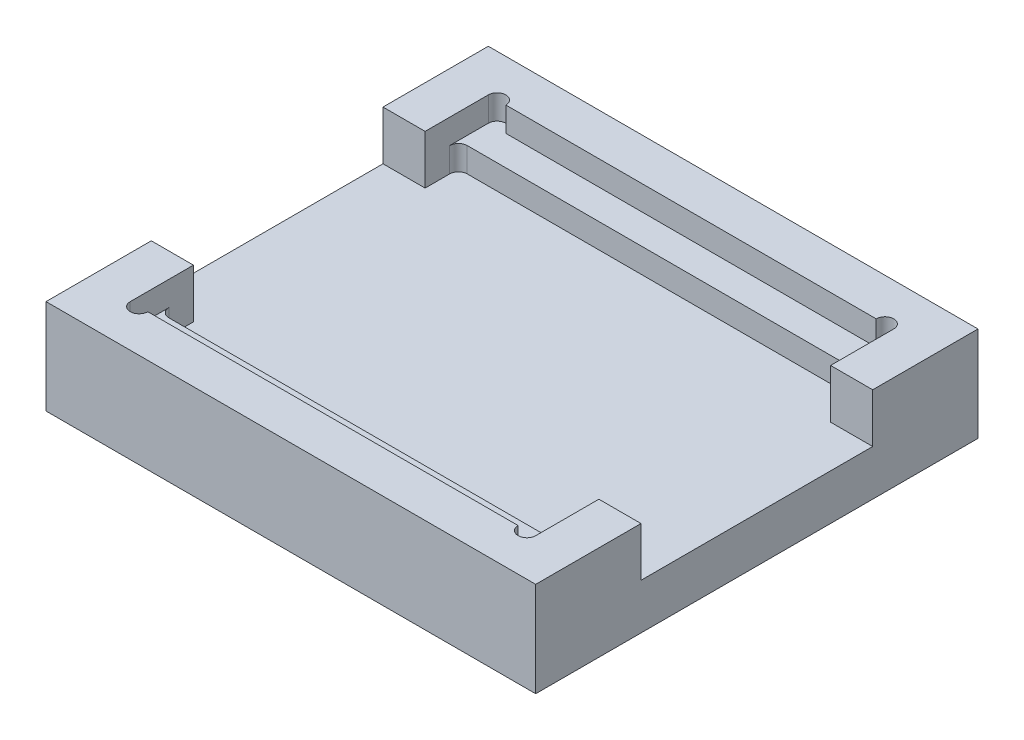
ISO-10303-21;
HEADER;
FILE_DESCRIPTION(('STEP AP214'),'2;1');
FILE_NAME('part.step','',(''),(''),'','','');
FILE_SCHEMA(('AUTOMOTIVE_DESIGN { 1 0 10303 214 1 1 1 1 }'));
ENDSEC;
DATA;
#1=APPLICATION_CONTEXT('core data for automotive mechanical design processes');
#2=APPLICATION_PROTOCOL_DEFINITION('international standard','automotive_design',2000,#1);
#3=PRODUCT_CONTEXT('',#1,'mechanical');
#4=PRODUCT('Part','Part','',(#3));
#5=PRODUCT_RELATED_PRODUCT_CATEGORY('part','',(#4));
#6=PRODUCT_DEFINITION_FORMATION('','',#4);
#7=PRODUCT_DEFINITION_CONTEXT('part definition',#1,'design');
#8=PRODUCT_DEFINITION('design','',#6,#7);
#9=PRODUCT_DEFINITION_SHAPE('','',#8);
#10=(LENGTH_UNIT() NAMED_UNIT(*) SI_UNIT(.MILLI.,.METRE.));
#11=(NAMED_UNIT(*) PLANE_ANGLE_UNIT() SI_UNIT($,.RADIAN.));
#12=(NAMED_UNIT(*) SI_UNIT($,.STERADIAN.) SOLID_ANGLE_UNIT());
#13=UNCERTAINTY_MEASURE_WITH_UNIT(LENGTH_MEASURE(1.E-05),#10,'distance_accuracy_value','');
#14=(GEOMETRIC_REPRESENTATION_CONTEXT(3) GLOBAL_UNCERTAINTY_ASSIGNED_CONTEXT((#13)) GLOBAL_UNIT_ASSIGNED_CONTEXT((#10,
#11,#12)) REPRESENTATION_CONTEXT('',''));
#15=CARTESIAN_POINT('',(0.,0.,0.));
#16=DIRECTION('',(0.,0.,1.));
#17=DIRECTION('',(1.,0.,0.));
#18=AXIS2_PLACEMENT_3D('',#15,#16,#17);
#19=CARTESIAN_POINT('',(0.,27.,0.));
#20=DIRECTION('',(0.,-1.,0.));
#21=DIRECTION('',(0.,0.,-1.));
#22=AXIS2_PLACEMENT_3D('',#19,#20,#21);
#23=PLANE('',#22);
#24=DIRECTION('',(0.,0.,-1.));
#25=VECTOR('',#24,1.);
#26=CARTESIAN_POINT('',(127.5,27.,-114.));
#27=LINE('',#26,#25);
#28=CARTESIAN_POINT('',(127.5,27.,-12.));
#29=VERTEX_POINT('',#28);
#30=CARTESIAN_POINT('',(127.5,27.,-30.));
#31=VERTEX_POINT('',#30);
#32=EDGE_CURVE('E259',#29,#31,#27,.T.);
#33=ORIENTED_EDGE('',*,*,#32,.F.);
#34=CARTESIAN_POINT('',(125.,27.,-12.));
#35=DIRECTION('',(0.,1.,0.));
#36=DIRECTION('',(0.,0.,-1.));
#37=AXIS2_PLACEMENT_3D('',#34,#35,#36);
#38=CIRCLE('',#37,2.5);
#39=CARTESIAN_POINT('',(122.5,27.,-12.));
#40=VERTEX_POINT('',#39);
#41=EDGE_CURVE('E590',#40,#29,#38,.T.);
#42=ORIENTED_EDGE('',*,*,#41,.F.);
#43=DIRECTION('',(1.,0.,0.));
#44=VECTOR('',#43,1.);
#45=CARTESIAN_POINT('',(11.9999999999999,27.,-12.));
#46=LINE('',#45,#44);
#47=CARTESIAN_POINT('',(16.9999999999999,27.,-12.));
#48=VERTEX_POINT('',#47);
#49=EDGE_CURVE('E436',#48,#40,#46,.T.);
#50=ORIENTED_EDGE('',*,*,#49,.F.);
#51=CARTESIAN_POINT('',(14.4999999999999,27.,-12.));
#52=DIRECTION('',(0.,1.,0.));
#53=DIRECTION('',(0.,0.,1.));
#54=AXIS2_PLACEMENT_3D('',#51,#52,#53);
#55=CIRCLE('',#54,2.5);
#56=CARTESIAN_POINT('',(11.9999999999999,27.,-12.));
#57=VERTEX_POINT('',#56);
#58=EDGE_CURVE('E579',#57,#48,#55,.T.);
#59=ORIENTED_EDGE('',*,*,#58,.F.);
#60=DIRECTION('',(0.,0.,1.));
#61=VECTOR('',#60,1.);
#62=CARTESIAN_POINT('',(11.9999999999999,27.,-114.));
#63=LINE('',#62,#61);
#64=CARTESIAN_POINT('',(11.9999999999999,27.,-30.));
#65=VERTEX_POINT('',#64);
#66=EDGE_CURVE('E414',#65,#57,#63,.T.);
#67=ORIENTED_EDGE('',*,*,#66,.F.);
#68=DIRECTION('',(1.,0.,0.));
#69=VECTOR('',#68,1.);
#70=CARTESIAN_POINT('',(1.37667655053519E-13,27.,-30.));
#71=LINE('',#70,#69);
#72=CARTESIAN_POINT('',(1.37667655053519E-13,27.,-30.));
#73=VERTEX_POINT('',#72);
#74=EDGE_CURVE('E483',#73,#65,#71,.T.);
#75=ORIENTED_EDGE('',*,*,#74,.F.);
#76=DIRECTION('',(0.,0.,1.));
#77=VECTOR('',#76,1.);
#78=CARTESIAN_POINT('',(0.,27.,0.));
#79=LINE('',#78,#77);
#80=CARTESIAN_POINT('',(0.,27.,0.));
#81=VERTEX_POINT('',#80);
#82=EDGE_CURVE('E290',#73,#81,#79,.T.);
#83=ORIENTED_EDGE('',*,*,#82,.T.);
#84=DIRECTION('',(1.,0.,0.));
#85=VECTOR('',#84,1.);
#86=CARTESIAN_POINT('',(0.,27.,0.));
#87=LINE('',#86,#85);
#88=CARTESIAN_POINT('',(139.5,27.,0.));
#89=VERTEX_POINT('',#88);
#90=EDGE_CURVE('E289',#81,#89,#87,.T.);
#91=ORIENTED_EDGE('',*,*,#90,.T.);
#92=DIRECTION('',(0.,0.,-1.));
#93=VECTOR('',#92,1.);
#94=CARTESIAN_POINT('',(139.5,27.,0.));
#95=LINE('',#94,#93);
#96=CARTESIAN_POINT('',(139.5,27.,-30.));
#97=VERTEX_POINT('',#96);
#98=EDGE_CURVE('E294',#89,#97,#95,.T.);
#99=ORIENTED_EDGE('',*,*,#98,.T.);
#100=DIRECTION('',(1.,0.,0.));
#101=VECTOR('',#100,1.);
#102=CARTESIAN_POINT('',(139.5,27.,-30.));
#103=LINE('',#102,#101);
#104=EDGE_CURVE('E457',#31,#97,#103,.T.);
#105=ORIENTED_EDGE('',*,*,#104,.F.);
#106=EDGE_LOOP('',(#33,#42,#50,#59,#67,#75,#83,#91,#99,#105));
#107=FACE_BOUND('',#106,.T.);
#108=ADVANCED_FACE('F44',(#107),#23,.F.);
#109=CARTESIAN_POINT('',(127.5,20.,-114.));
#110=DIRECTION('',(1.,0.,0.));
#111=DIRECTION('',(0.,0.,-1.));
#112=AXIS2_PLACEMENT_3D('',#109,#110,#111);
#113=PLANE('',#112);
#114=DIRECTION('',(0.,0.,-1.));
#115=VECTOR('',#114,1.);
#116=CARTESIAN_POINT('',(127.5,13.,-105.5));
#117=LINE('',#116,#115);
#118=CARTESIAN_POINT('',(127.5,13.,-23.));
#119=VERTEX_POINT('',#118);
#120=CARTESIAN_POINT('',(127.5,13.,-30.));
#121=VERTEX_POINT('',#120);
#122=EDGE_CURVE('E408',#119,#121,#117,.T.);
#123=ORIENTED_EDGE('',*,*,#122,.F.);
#124=DIRECTION('',(0.,1.,0.));
#125=VECTOR('',#124,1.);
#126=CARTESIAN_POINT('',(127.5,20.,-23.));
#127=LINE('',#126,#125);
#128=CARTESIAN_POINT('',(127.5,20.,-23.));
#129=VERTEX_POINT('',#128);
#130=EDGE_CURVE('E329',#119,#129,#127,.T.);
#131=ORIENTED_EDGE('',*,*,#130,.T.);
#132=DIRECTION('',(0.,0.,-1.));
#133=VECTOR('',#132,1.);
#134=CARTESIAN_POINT('',(127.5,20.,-114.));
#135=LINE('',#134,#133);
#136=CARTESIAN_POINT('',(127.5,20.,-12.));
#137=VERTEX_POINT('',#136);
#138=EDGE_CURVE('E429',#137,#129,#135,.T.);
#139=ORIENTED_EDGE('',*,*,#138,.F.);
#140=DIRECTION('',(0.,1.,0.));
#141=VECTOR('',#140,1.);
#142=CARTESIAN_POINT('',(127.5,20.,-12.));
#143=LINE('',#142,#141);
#144=EDGE_CURVE('E278',#137,#29,#143,.T.);
#145=ORIENTED_EDGE('',*,*,#144,.T.);
#146=ORIENTED_EDGE('',*,*,#32,.T.);
#147=DIRECTION('',(0.,1.,0.));
#148=VECTOR('',#147,1.);
#149=CARTESIAN_POINT('',(127.5,13.,-30.));
#150=LINE('',#149,#148);
#151=EDGE_CURVE('E571',#121,#31,#150,.T.);
#152=ORIENTED_EDGE('',*,*,#151,.F.);
#153=EDGE_LOOP('',(#123,#131,#139,#145,#146,#152));
#154=FACE_BOUND('',#153,.T.);
#155=ADVANCED_FACE('F609',(#154),#113,.F.);
#156=CARTESIAN_POINT('',(11.9999999999999,20.,-114.));
#157=DIRECTION('',(-1.,0.,0.));
#158=DIRECTION('',(0.,0.,1.));
#159=AXIS2_PLACEMENT_3D('',#156,#157,#158);
#160=PLANE('',#159);
#161=DIRECTION('',(0.,0.,1.));
#162=VECTOR('',#161,1.);
#163=CARTESIAN_POINT('',(11.9999999999999,13.,-105.5));
#164=LINE('',#163,#162);
#165=CARTESIAN_POINT('',(11.9999999999999,13.,-103.));
#166=VERTEX_POINT('',#165);
#167=CARTESIAN_POINT('',(11.9999999999999,13.,-96.));
#168=VERTEX_POINT('',#167);
#169=EDGE_CURVE('E400',#166,#168,#164,.T.);
#170=ORIENTED_EDGE('',*,*,#169,.F.);
#171=DIRECTION('',(0.,1.,0.));
#172=VECTOR('',#171,1.);
#173=CARTESIAN_POINT('',(11.9999999999999,20.,-103.));
#174=LINE('',#173,#172);
#175=CARTESIAN_POINT('',(11.9999999999999,20.,-103.));
#176=VERTEX_POINT('',#175);
#177=EDGE_CURVE('E365',#166,#176,#174,.T.);
#178=ORIENTED_EDGE('',*,*,#177,.T.);
#179=DIRECTION('',(0.,0.,1.));
#180=VECTOR('',#179,1.);
#181=CARTESIAN_POINT('',(11.9999999999999,20.,-114.));
#182=LINE('',#181,#180);
#183=CARTESIAN_POINT('',(11.9999999999999,20.,-114.));
#184=VERTEX_POINT('',#183);
#185=EDGE_CURVE('E59',#184,#176,#182,.T.);
#186=ORIENTED_EDGE('',*,*,#185,.F.);
#187=DIRECTION('',(0.,1.,0.));
#188=VECTOR('',#187,1.);
#189=CARTESIAN_POINT('',(11.9999999999999,20.,-114.));
#190=LINE('',#189,#188);
#191=CARTESIAN_POINT('',(11.9999999999999,27.,-114.));
#192=VERTEX_POINT('',#191);
#193=EDGE_CURVE('E271',#184,#192,#190,.T.);
#194=ORIENTED_EDGE('',*,*,#193,.T.);
#195=CARTESIAN_POINT('',(11.9999999999999,27.,-96.));
#196=VERTEX_POINT('',#195);
#197=EDGE_CURVE('E433',#192,#196,#63,.T.);
#198=ORIENTED_EDGE('',*,*,#197,.T.);
#199=DIRECTION('',(0.,1.,0.));
#200=VECTOR('',#199,1.);
#201=CARTESIAN_POINT('',(11.9999999999999,13.,-96.));
#202=LINE('',#201,#200);
#203=EDGE_CURVE('E492',#168,#196,#202,.T.);
#204=ORIENTED_EDGE('',*,*,#203,.F.);
#205=EDGE_LOOP('',(#170,#178,#186,#194,#198,#204));
#206=FACE_BOUND('',#205,.T.);
#207=ADVANCED_FACE('F526',(#206),#160,.F.);
#208=CARTESIAN_POINT('',(0.,20.,0.));
#209=DIRECTION('',(0.,1.,0.));
#210=DIRECTION('',(0.,0.,1.));
#211=AXIS2_PLACEMENT_3D('',#208,#209,#210);
#212=PLANE('',#211);
#213=DIRECTION('',(-1.,0.,0.));
#214=VECTOR('',#213,1.);
#215=CARTESIAN_POINT('',(127.5,20.,-105.5));
#216=LINE('',#215,#214);
#217=CARTESIAN_POINT('',(125.,20.,-105.5));
#218=VERTEX_POINT('',#217);
#219=CARTESIAN_POINT('',(14.4999999999999,20.,-105.5));
#220=VERTEX_POINT('',#219);
#221=EDGE_CURVE('E415',#218,#220,#216,.T.);
#222=ORIENTED_EDGE('',*,*,#221,.F.);
#223=CARTESIAN_POINT('',(125.,20.,-103.));
#224=DIRECTION('',(0.,1.,0.));
#225=DIRECTION('',(0.,0.,1.));
#226=AXIS2_PLACEMENT_3D('',#223,#224,#225);
#227=CIRCLE('',#226,2.5);
#228=CARTESIAN_POINT('',(127.5,20.,-103.));
#229=VERTEX_POINT('',#228);
#230=EDGE_CURVE('E372',#218,#229,#227,.F.);
#231=ORIENTED_EDGE('',*,*,#230,.T.);
#232=CARTESIAN_POINT('',(127.5,20.,-114.));
#233=VERTEX_POINT('',#232);
#234=EDGE_CURVE('E428',#229,#233,#135,.T.);
#235=ORIENTED_EDGE('',*,*,#234,.T.);
#236=CARTESIAN_POINT('',(125.,20.,-114.));
#237=DIRECTION('',(0.,1.,0.));
#238=DIRECTION('',(0.,0.,1.));
#239=AXIS2_PLACEMENT_3D('',#236,#237,#238);
#240=CIRCLE('',#239,2.5);
#241=CARTESIAN_POINT('',(122.5,20.,-114.));
#242=VERTEX_POINT('',#241);
#243=EDGE_CURVE('E252',#242,#233,#240,.F.);
#244=ORIENTED_EDGE('',*,*,#243,.F.);
#245=DIRECTION('',(-1.,0.,0.));
#246=VECTOR('',#245,1.);
#247=CARTESIAN_POINT('',(11.9999999999999,20.,-114.));
#248=LINE('',#247,#246);
#249=CARTESIAN_POINT('',(16.9999999999999,20.,-114.));
#250=VERTEX_POINT('',#249);
#251=EDGE_CURVE('E250',#242,#250,#248,.T.);
#252=ORIENTED_EDGE('',*,*,#251,.T.);
#253=CARTESIAN_POINT('',(14.4999999999999,20.,-114.));
#254=DIRECTION('',(0.,1.,0.));
#255=DIRECTION('',(0.,0.,1.));
#256=AXIS2_PLACEMENT_3D('',#253,#254,#255);
#257=CIRCLE('',#256,2.5);
#258=EDGE_CURVE('E587',#184,#250,#257,.F.);
#259=ORIENTED_EDGE('',*,*,#258,.F.);
#260=ORIENTED_EDGE('',*,*,#185,.T.);
#261=CARTESIAN_POINT('',(14.4999999999999,20.,-103.));
#262=DIRECTION('',(0.,1.,0.));
#263=DIRECTION('',(0.,0.,1.));
#264=AXIS2_PLACEMENT_3D('',#261,#262,#263);
#265=CIRCLE('',#264,2.5);
#266=EDGE_CURVE('E12',#176,#220,#265,.F.);
#267=ORIENTED_EDGE('',*,*,#266,.T.);
#268=EDGE_LOOP('',(#222,#231,#235,#244,#252,#259,#260,#267));
#269=FACE_BOUND('',#268,.T.);
#270=ADVANCED_FACE('F519',(#269),#212,.T.);
#271=CARTESIAN_POINT('',(0.,27.,0.));
#272=DIRECTION('',(1.,0.,0.));
#273=DIRECTION('',(0.,0.,-1.));
#274=AXIS2_PLACEMENT_3D('',#271,#272,#273);
#275=PLANE('',#274);
#276=DIRECTION('',(0.,0.,1.));
#277=VECTOR('',#276,1.);
#278=CARTESIAN_POINT('',(1.37667655053519E-13,13.,-30.));
#279=LINE('',#278,#277);
#280=CARTESIAN_POINT('',(0.,13.,-96.));
#281=VERTEX_POINT('',#280);
#282=CARTESIAN_POINT('',(1.37667655053519E-13,13.,-30.));
#283=VERTEX_POINT('',#282);
#284=EDGE_CURVE('E472',#281,#283,#279,.T.);
#285=ORIENTED_EDGE('',*,*,#284,.F.);
#286=DIRECTION('',(0.,1.,0.));
#287=VECTOR('',#286,1.);
#288=CARTESIAN_POINT('',(0.,13.,-96.));
#289=LINE('',#288,#287);
#290=CARTESIAN_POINT('',(0.,27.,-96.));
#291=VERTEX_POINT('',#290);
#292=EDGE_CURVE('E419',#281,#291,#289,.T.);
#293=ORIENTED_EDGE('',*,*,#292,.T.);
#294=CARTESIAN_POINT('',(0.,27.,-126.));
#295=VERTEX_POINT('',#294);
#296=EDGE_CURVE('E285',#295,#291,#79,.T.);
#297=ORIENTED_EDGE('',*,*,#296,.F.);
#298=DIRECTION('',(0.,-1.,0.));
#299=VECTOR('',#298,1.);
#300=CARTESIAN_POINT('',(0.,27.,-126.));
#301=LINE('',#300,#299);
#302=CARTESIAN_POINT('',(0.,0.,-126.));
#303=VERTEX_POINT('',#302);
#304=EDGE_CURVE('E301',#295,#303,#301,.T.);
#305=ORIENTED_EDGE('',*,*,#304,.T.);
#306=DIRECTION('',(0.,0.,1.));
#307=VECTOR('',#306,1.);
#308=CARTESIAN_POINT('',(0.,0.,0.));
#309=LINE('',#308,#307);
#310=CARTESIAN_POINT('',(0.,0.,0.));
#311=VERTEX_POINT('',#310);
#312=EDGE_CURVE('E275',#303,#311,#309,.T.);
#313=ORIENTED_EDGE('',*,*,#312,.T.);
#314=DIRECTION('',(0.,-1.,0.));
#315=VECTOR('',#314,1.);
#316=CARTESIAN_POINT('',(0.,27.,0.));
#317=LINE('',#316,#315);
#318=EDGE_CURVE('E325',#81,#311,#317,.T.);
#319=ORIENTED_EDGE('',*,*,#318,.F.);
#320=ORIENTED_EDGE('',*,*,#82,.F.);
#321=DIRECTION('',(0.,1.,0.));
#322=VECTOR('',#321,1.);
#323=CARTESIAN_POINT('',(1.37667655053519E-13,13.,-30.));
#324=LINE('',#323,#322);
#325=EDGE_CURVE('E476',#283,#73,#324,.T.);
#326=ORIENTED_EDGE('',*,*,#325,.F.);
#327=EDGE_LOOP('',(#285,#293,#297,#305,#313,#319,#320,#326));
#328=FACE_BOUND('',#327,.T.);
#329=ADVANCED_FACE('F535',(#328),#275,.F.);
#330=CARTESIAN_POINT('',(0.,27.,0.));
#331=DIRECTION('',(0.,0.,-1.));
#332=DIRECTION('',(-1.,0.,0.));
#333=AXIS2_PLACEMENT_3D('',#330,#331,#332);
#334=PLANE('',#333);
#335=DIRECTION('',(1.,0.,0.));
#336=VECTOR('',#335,1.);
#337=CARTESIAN_POINT('',(0.,0.,0.));
#338=LINE('',#337,#336);
#339=CARTESIAN_POINT('',(139.5,0.,0.));
#340=VERTEX_POINT('',#339);
#341=EDGE_CURVE('E305',#311,#340,#338,.T.);
#342=ORIENTED_EDGE('',*,*,#341,.T.);
#343=DIRECTION('',(0.,-1.,0.));
#344=VECTOR('',#343,1.);
#345=CARTESIAN_POINT('',(139.5,27.,0.));
#346=LINE('',#345,#344);
#347=EDGE_CURVE('E321',#89,#340,#346,.T.);
#348=ORIENTED_EDGE('',*,*,#347,.F.);
#349=ORIENTED_EDGE('',*,*,#90,.F.);
#350=ORIENTED_EDGE('',*,*,#318,.T.);
#351=EDGE_LOOP('',(#342,#348,#349,#350));
#352=FACE_BOUND('',#351,.T.);
#353=ADVANCED_FACE('F549',(#352),#334,.F.);
#354=CARTESIAN_POINT('',(139.5,27.,0.));
#355=DIRECTION('',(-1.,0.,0.));
#356=DIRECTION('',(0.,0.,1.));
#357=AXIS2_PLACEMENT_3D('',#354,#355,#356);
#358=PLANE('',#357);
#359=DIRECTION('',(0.,0.,-1.));
#360=VECTOR('',#359,1.);
#361=CARTESIAN_POINT('',(139.5,13.,-96.));
#362=LINE('',#361,#360);
#363=CARTESIAN_POINT('',(139.5,13.,-30.));
#364=VERTEX_POINT('',#363);
#365=CARTESIAN_POINT('',(139.5,13.,-96.));
#366=VERTEX_POINT('',#365);
#367=EDGE_CURVE('E556',#364,#366,#362,.T.);
#368=ORIENTED_EDGE('',*,*,#367,.F.);
#369=DIRECTION('',(0.,1.,0.));
#370=VECTOR('',#369,1.);
#371=CARTESIAN_POINT('',(139.5,13.,-30.));
#372=LINE('',#371,#370);
#373=EDGE_CURVE('E486',#364,#97,#372,.T.);
#374=ORIENTED_EDGE('',*,*,#373,.T.);
#375=ORIENTED_EDGE('',*,*,#98,.F.);
#376=ORIENTED_EDGE('',*,*,#347,.T.);
#377=DIRECTION('',(0.,0.,-1.));
#378=VECTOR('',#377,1.);
#379=CARTESIAN_POINT('',(139.5,0.,0.));
#380=LINE('',#379,#378);
#381=CARTESIAN_POINT('',(139.5,0.,-126.));
#382=VERTEX_POINT('',#381);
#383=EDGE_CURVE('E308',#340,#382,#380,.T.);
#384=ORIENTED_EDGE('',*,*,#383,.T.);
#385=DIRECTION('',(0.,-1.,0.));
#386=VECTOR('',#385,1.);
#387=CARTESIAN_POINT('',(139.5,27.,-126.));
#388=LINE('',#387,#386);
#389=CARTESIAN_POINT('',(139.5,27.,-126.));
#390=VERTEX_POINT('',#389);
#391=EDGE_CURVE('E317',#390,#382,#388,.T.);
#392=ORIENTED_EDGE('',*,*,#391,.F.);
#393=CARTESIAN_POINT('',(139.5,27.,-96.));
#394=VERTEX_POINT('',#393);
#395=EDGE_CURVE('E293',#394,#390,#95,.T.);
#396=ORIENTED_EDGE('',*,*,#395,.F.);
#397=DIRECTION('',(0.,1.,0.));
#398=VECTOR('',#397,1.);
#399=CARTESIAN_POINT('',(139.5,13.,-96.));
#400=LINE('',#399,#398);
#401=EDGE_CURVE('E464',#366,#394,#400,.T.);
#402=ORIENTED_EDGE('',*,*,#401,.F.);
#403=EDGE_LOOP('',(#368,#374,#375,#376,#384,#392,#396,#402));
#404=FACE_BOUND('',#403,.T.);
#405=ADVANCED_FACE('F463',(#404),#358,.F.);
#406=CARTESIAN_POINT('',(0.,27.,-126.));
#407=DIRECTION('',(0.,0.,1.));
#408=DIRECTION('',(1.,0.,0.));
#409=AXIS2_PLACEMENT_3D('',#406,#407,#408);
#410=PLANE('',#409);
#411=DIRECTION('',(-1.,0.,0.));
#412=VECTOR('',#411,1.);
#413=CARTESIAN_POINT('',(0.,0.,-126.));
#414=LINE('',#413,#412);
#415=EDGE_CURVE('E311',#382,#303,#414,.T.);
#416=ORIENTED_EDGE('',*,*,#415,.T.);
#417=ORIENTED_EDGE('',*,*,#304,.F.);
#418=DIRECTION('',(-1.,0.,0.));
#419=VECTOR('',#418,1.);
#420=CARTESIAN_POINT('',(0.,27.,-126.));
#421=LINE('',#420,#419);
#422=EDGE_CURVE('E298',#390,#295,#421,.T.);
#423=ORIENTED_EDGE('',*,*,#422,.F.);
#424=ORIENTED_EDGE('',*,*,#391,.T.);
#425=EDGE_LOOP('',(#416,#417,#423,#424));
#426=FACE_BOUND('',#425,.T.);
#427=ADVANCED_FACE('F539',(#426),#410,.F.);
#428=ORIENTED_EDGE('',*,*,#197,.F.);
#429=CARTESIAN_POINT('',(14.4999999999999,27.,-114.));
#430=DIRECTION('',(0.,1.,0.));
#431=DIRECTION('',(0.,0.,-1.));
#432=AXIS2_PLACEMENT_3D('',#429,#430,#431);
#433=CIRCLE('',#432,2.5);
#434=CARTESIAN_POINT('',(16.9999999999999,27.,-114.));
#435=VERTEX_POINT('',#434);
#436=EDGE_CURVE('E257',#435,#192,#433,.T.);
#437=ORIENTED_EDGE('',*,*,#436,.F.);
#438=DIRECTION('',(-1.,0.,0.));
#439=VECTOR('',#438,1.);
#440=CARTESIAN_POINT('',(11.9999999999999,27.,-114.));
#441=LINE('',#440,#439);
#442=CARTESIAN_POINT('',(122.5,27.,-114.));
#443=VERTEX_POINT('',#442);
#444=EDGE_CURVE('E248',#443,#435,#441,.T.);
#445=ORIENTED_EDGE('',*,*,#444,.F.);
#446=CARTESIAN_POINT('',(125.,27.,-114.));
#447=DIRECTION('',(0.,1.,0.));
#448=DIRECTION('',(0.,0.,1.));
#449=AXIS2_PLACEMENT_3D('',#446,#447,#448);
#450=CIRCLE('',#449,2.5);
#451=CARTESIAN_POINT('',(127.5,27.,-114.));
#452=VERTEX_POINT('',#451);
#453=EDGE_CURVE('E231',#452,#443,#450,.T.);
#454=ORIENTED_EDGE('',*,*,#453,.F.);
#455=CARTESIAN_POINT('',(127.5,27.,-96.));
#456=VERTEX_POINT('',#455);
#457=EDGE_CURVE('E267',#456,#452,#27,.T.);
#458=ORIENTED_EDGE('',*,*,#457,.F.);
#459=DIRECTION('',(-1.,0.,0.));
#460=VECTOR('',#459,1.);
#461=CARTESIAN_POINT('',(139.5,27.,-96.));
#462=LINE('',#461,#460);
#463=EDGE_CURVE('E452',#394,#456,#462,.T.);
#464=ORIENTED_EDGE('',*,*,#463,.F.);
#465=ORIENTED_EDGE('',*,*,#395,.T.);
#466=ORIENTED_EDGE('',*,*,#422,.T.);
#467=ORIENTED_EDGE('',*,*,#296,.T.);
#468=DIRECTION('',(-1.,0.,0.));
#469=VECTOR('',#468,1.);
#470=CARTESIAN_POINT('',(0.,27.,-96.));
#471=LINE('',#470,#469);
#472=EDGE_CURVE('E479',#196,#291,#471,.T.);
#473=ORIENTED_EDGE('',*,*,#472,.F.);
#474=EDGE_LOOP('',(#428,#437,#445,#454,#458,#464,#465,#466,#467,#473));
#475=FACE_BOUND('',#474,.T.);
#476=ADVANCED_FACE('F256',(#475),#23,.F.);
#477=CARTESIAN_POINT('',(0.,0.,0.));
#478=DIRECTION('',(0.,-1.,0.));
#479=DIRECTION('',(0.,0.,-1.));
#480=AXIS2_PLACEMENT_3D('',#477,#478,#479);
#481=PLANE('',#480);
#482=ORIENTED_EDGE('',*,*,#312,.F.);
#483=ORIENTED_EDGE('',*,*,#415,.F.);
#484=ORIENTED_EDGE('',*,*,#383,.F.);
#485=ORIENTED_EDGE('',*,*,#341,.F.);
#486=EDGE_LOOP('',(#482,#483,#484,#485));
#487=FACE_BOUND('',#486,.T.);
#488=ADVANCED_FACE('F544',(#487),#481,.T.);
#489=CARTESIAN_POINT('',(11.9999999999999,20.,-23.));
#490=VERTEX_POINT('',#489);
#491=CARTESIAN_POINT('',(11.9999999999999,20.,-12.));
#492=VERTEX_POINT('',#491);
#493=EDGE_CURVE('E67',#490,#492,#182,.T.);
#494=ORIENTED_EDGE('',*,*,#493,.F.);
#495=DIRECTION('',(0.,1.,0.));
#496=VECTOR('',#495,1.);
#497=CARTESIAN_POINT('',(11.9999999999999,13.,-23.));
#498=LINE('',#497,#496);
#499=CARTESIAN_POINT('',(11.9999999999999,13.,-23.));
#500=VERTEX_POINT('',#499);
#501=EDGE_CURVE('E362',#490,#500,#498,.F.);
#502=ORIENTED_EDGE('',*,*,#501,.T.);
#503=CARTESIAN_POINT('',(11.9999999999999,13.,-30.));
#504=VERTEX_POINT('',#503);
#505=EDGE_CURVE('E392',#504,#500,#164,.T.);
#506=ORIENTED_EDGE('',*,*,#505,.F.);
#507=DIRECTION('',(0.,1.,0.));
#508=VECTOR('',#507,1.);
#509=CARTESIAN_POINT('',(11.9999999999999,13.,-30.));
#510=LINE('',#509,#508);
#511=EDGE_CURVE('E495',#504,#65,#510,.T.);
#512=ORIENTED_EDGE('',*,*,#511,.T.);
#513=ORIENTED_EDGE('',*,*,#66,.T.);
#514=DIRECTION('',(0.,1.,0.));
#515=VECTOR('',#514,1.);
#516=CARTESIAN_POINT('',(11.9999999999999,20.,-12.));
#517=LINE('',#516,#515);
#518=EDGE_CURVE('E282',#492,#57,#517,.T.);
#519=ORIENTED_EDGE('',*,*,#518,.F.);
#520=EDGE_LOOP('',(#494,#502,#506,#512,#513,#519));
#521=FACE_BOUND('',#520,.T.);
#522=ADVANCED_FACE('F390',(#521),#160,.F.);
#523=CARTESIAN_POINT('',(11.9999999999999,20.,-114.));
#524=DIRECTION('',(0.,0.,-1.));
#525=DIRECTION('',(-1.,0.,0.));
#526=AXIS2_PLACEMENT_3D('',#523,#524,#525);
#527=PLANE('',#526);
#528=ORIENTED_EDGE('',*,*,#444,.T.);
#529=DIRECTION('',(0.,1.,0.));
#530=VECTOR('',#529,1.);
#531=CARTESIAN_POINT('',(16.9999999999999,14.4098300562505,-114.));
#532=LINE('',#531,#530);
#533=EDGE_CURVE('E585',#250,#435,#532,.T.);
#534=ORIENTED_EDGE('',*,*,#533,.F.);
#535=ORIENTED_EDGE('',*,*,#251,.F.);
#536=DIRECTION('',(0.,1.,0.));
#537=VECTOR('',#536,1.);
#538=CARTESIAN_POINT('',(122.5,14.4098300562505,-114.));
#539=LINE('',#538,#537);
#540=EDGE_CURVE('E234',#242,#443,#539,.T.);
#541=ORIENTED_EDGE('',*,*,#540,.T.);
#542=EDGE_LOOP('',(#528,#534,#535,#541));
#543=FACE_BOUND('',#542,.T.);
#544=ADVANCED_FACE('F246',(#543),#527,.F.);
#545=ORIENTED_EDGE('',*,*,#234,.F.);
#546=DIRECTION('',(0.,1.,0.));
#547=VECTOR('',#546,1.);
#548=CARTESIAN_POINT('',(127.5,13.,-103.));
#549=LINE('',#548,#547);
#550=CARTESIAN_POINT('',(127.5,13.,-103.));
#551=VERTEX_POINT('',#550);
#552=EDGE_CURVE('E359',#229,#551,#549,.F.);
#553=ORIENTED_EDGE('',*,*,#552,.T.);
#554=CARTESIAN_POINT('',(127.5,13.,-96.));
#555=VERTEX_POINT('',#554);
#556=EDGE_CURVE('E421',#555,#551,#117,.T.);
#557=ORIENTED_EDGE('',*,*,#556,.F.);
#558=DIRECTION('',(0.,1.,0.));
#559=VECTOR('',#558,1.);
#560=CARTESIAN_POINT('',(127.5,13.,-96.));
#561=LINE('',#560,#559);
#562=EDGE_CURVE('E450',#555,#456,#561,.T.);
#563=ORIENTED_EDGE('',*,*,#562,.T.);
#564=ORIENTED_EDGE('',*,*,#457,.T.);
#565=DIRECTION('',(0.,1.,0.));
#566=VECTOR('',#565,1.);
#567=CARTESIAN_POINT('',(127.5,20.,-114.));
#568=LINE('',#567,#566);
#569=EDGE_CURVE('E237',#233,#452,#568,.T.);
#570=ORIENTED_EDGE('',*,*,#569,.F.);
#571=EDGE_LOOP('',(#545,#553,#557,#563,#564,#570));
#572=FACE_BOUND('',#571,.T.);
#573=ADVANCED_FACE('F447',(#572),#113,.F.);
#574=CARTESIAN_POINT('',(11.9999999999999,20.,-12.));
#575=DIRECTION('',(0.,0.,1.));
#576=DIRECTION('',(1.,0.,0.));
#577=AXIS2_PLACEMENT_3D('',#574,#575,#576);
#578=PLANE('',#577);
#579=ORIENTED_EDGE('',*,*,#49,.T.);
#580=DIRECTION('',(0.,1.,0.));
#581=VECTOR('',#580,1.);
#582=CARTESIAN_POINT('',(122.5,14.4098300562505,-12.));
#583=LINE('',#582,#581);
#584=CARTESIAN_POINT('',(122.5,20.,-12.));
#585=VERTEX_POINT('',#584);
#586=EDGE_CURVE('E591',#585,#40,#583,.T.);
#587=ORIENTED_EDGE('',*,*,#586,.F.);
#588=DIRECTION('',(1.,0.,0.));
#589=VECTOR('',#588,1.);
#590=CARTESIAN_POINT('',(11.9999999999999,20.,-12.));
#591=LINE('',#590,#589);
#592=CARTESIAN_POINT('',(16.9999999999999,20.,-12.));
#593=VERTEX_POINT('',#592);
#594=EDGE_CURVE('E424',#593,#585,#591,.T.);
#595=ORIENTED_EDGE('',*,*,#594,.F.);
#596=DIRECTION('',(0.,1.,0.));
#597=VECTOR('',#596,1.);
#598=CARTESIAN_POINT('',(16.9999999999999,14.4098300562505,-12.));
#599=LINE('',#598,#597);
#600=EDGE_CURVE('E577',#593,#48,#599,.T.);
#601=ORIENTED_EDGE('',*,*,#600,.T.);
#602=EDGE_LOOP('',(#579,#587,#595,#601));
#603=FACE_BOUND('',#602,.T.);
#604=ADVANCED_FACE('F602',(#603),#578,.F.);
#605=DIRECTION('',(1.,0.,0.));
#606=VECTOR('',#605,1.);
#607=CARTESIAN_POINT('',(127.5,20.,-20.5));
#608=LINE('',#607,#606);
#609=CARTESIAN_POINT('',(14.4999999999999,20.,-20.5));
#610=VERTEX_POINT('',#609);
#611=CARTESIAN_POINT('',(125.,20.,-20.5));
#612=VERTEX_POINT('',#611);
#613=EDGE_CURVE('E383',#610,#612,#608,.T.);
#614=ORIENTED_EDGE('',*,*,#613,.F.);
#615=CARTESIAN_POINT('',(14.4999999999999,20.,-23.));
#616=DIRECTION('',(0.,1.,0.));
#617=DIRECTION('',(0.,0.,1.));
#618=AXIS2_PLACEMENT_3D('',#615,#616,#617);
#619=CIRCLE('',#618,2.5);
#620=EDGE_CURVE('E53',#610,#490,#619,.F.);
#621=ORIENTED_EDGE('',*,*,#620,.T.);
#622=ORIENTED_EDGE('',*,*,#493,.T.);
#623=CARTESIAN_POINT('',(14.4999999999999,20.,-12.));
#624=DIRECTION('',(0.,1.,0.));
#625=DIRECTION('',(0.,0.,1.));
#626=AXIS2_PLACEMENT_3D('',#623,#624,#625);
#627=CIRCLE('',#626,2.5);
#628=EDGE_CURVE('E458',#593,#492,#627,.F.);
#629=ORIENTED_EDGE('',*,*,#628,.F.);
#630=ORIENTED_EDGE('',*,*,#594,.T.);
#631=CARTESIAN_POINT('',(125.,20.,-12.));
#632=DIRECTION('',(0.,1.,0.));
#633=DIRECTION('',(0.,0.,1.));
#634=AXIS2_PLACEMENT_3D('',#631,#632,#633);
#635=CIRCLE('',#634,2.5);
#636=EDGE_CURVE('E582',#137,#585,#635,.F.);
#637=ORIENTED_EDGE('',*,*,#636,.F.);
#638=ORIENTED_EDGE('',*,*,#138,.T.);
#639=CARTESIAN_POINT('',(125.,20.,-23.));
#640=DIRECTION('',(0.,1.,0.));
#641=DIRECTION('',(0.,0.,1.));
#642=AXIS2_PLACEMENT_3D('',#639,#640,#641);
#643=CIRCLE('',#642,2.5);
#644=EDGE_CURVE('E369',#129,#612,#643,.F.);
#645=ORIENTED_EDGE('',*,*,#644,.T.);
#646=EDGE_LOOP('',(#614,#621,#622,#629,#630,#637,#638,#645));
#647=FACE_BOUND('',#646,.T.);
#648=ADVANCED_FACE('F380',(#647),#212,.T.);
#649=CARTESIAN_POINT('',(127.5,13.,-20.5));
#650=DIRECTION('',(0.,0.,1.));
#651=DIRECTION('',(1.,0.,0.));
#652=AXIS2_PLACEMENT_3D('',#649,#650,#651);
#653=PLANE('',#652);
#654=ORIENTED_EDGE('',*,*,#613,.T.);
#655=DIRECTION('',(0.,1.,0.));
#656=VECTOR('',#655,1.);
#657=CARTESIAN_POINT('',(125.,13.,-20.5));
#658=LINE('',#657,#656);
#659=CARTESIAN_POINT('',(125.,13.,-20.5));
#660=VERTEX_POINT('',#659);
#661=EDGE_CURVE('E337',#612,#660,#658,.F.);
#662=ORIENTED_EDGE('',*,*,#661,.T.);
#663=DIRECTION('',(1.,0.,0.));
#664=VECTOR('',#663,1.);
#665=CARTESIAN_POINT('',(127.5,13.,-20.5));
#666=LINE('',#665,#664);
#667=CARTESIAN_POINT('',(14.4999999999999,13.,-20.5));
#668=VERTEX_POINT('',#667);
#669=EDGE_CURVE('E405',#668,#660,#666,.T.);
#670=ORIENTED_EDGE('',*,*,#669,.F.);
#671=DIRECTION('',(0.,1.,0.));
#672=VECTOR('',#671,1.);
#673=CARTESIAN_POINT('',(14.4999999999999,20.,-20.5));
#674=LINE('',#673,#672);
#675=EDGE_CURVE('E333',#668,#610,#674,.T.);
#676=ORIENTED_EDGE('',*,*,#675,.T.);
#677=EDGE_LOOP('',(#654,#662,#670,#676));
#678=FACE_BOUND('',#677,.T.);
#679=ADVANCED_FACE('F618',(#678),#653,.F.);
#680=CARTESIAN_POINT('',(127.5,13.,-105.5));
#681=DIRECTION('',(0.,0.,-1.));
#682=DIRECTION('',(-1.,0.,0.));
#683=AXIS2_PLACEMENT_3D('',#680,#681,#682);
#684=PLANE('',#683);
#685=DIRECTION('',(-1.,0.,0.));
#686=VECTOR('',#685,1.);
#687=CARTESIAN_POINT('',(127.5,13.,-105.5));
#688=LINE('',#687,#686);
#689=CARTESIAN_POINT('',(125.,13.,-105.5));
#690=VERTEX_POINT('',#689);
#691=CARTESIAN_POINT('',(14.4999999999999,13.,-105.5));
#692=VERTEX_POINT('',#691);
#693=EDGE_CURVE('E401',#690,#692,#688,.T.);
#694=ORIENTED_EDGE('',*,*,#693,.F.);
#695=DIRECTION('',(0.,1.,0.));
#696=VECTOR('',#695,1.);
#697=CARTESIAN_POINT('',(125.,20.,-105.5));
#698=LINE('',#697,#696);
#699=EDGE_CURVE('E355',#690,#218,#698,.T.);
#700=ORIENTED_EDGE('',*,*,#699,.T.);
#701=ORIENTED_EDGE('',*,*,#221,.T.);
#702=DIRECTION('',(0.,1.,0.));
#703=VECTOR('',#702,1.);
#704=CARTESIAN_POINT('',(14.4999999999999,13.,-105.5));
#705=LINE('',#704,#703);
#706=EDGE_CURVE('E352',#220,#692,#705,.F.);
#707=ORIENTED_EDGE('',*,*,#706,.T.);
#708=EDGE_LOOP('',(#694,#700,#701,#707));
#709=FACE_BOUND('',#708,.T.);
#710=ADVANCED_FACE('F517',(#709),#684,.F.);
#711=CARTESIAN_POINT('',(0.,13.,0.));
#712=DIRECTION('',(0.,-1.,0.));
#713=DIRECTION('',(0.,0.,-1.));
#714=AXIS2_PLACEMENT_3D('',#711,#712,#713);
#715=PLANE('',#714);
#716=ORIENTED_EDGE('',*,*,#669,.T.);
#717=CARTESIAN_POINT('',(125.,13.,-23.));
#718=DIRECTION('',(0.,-1.,0.));
#719=DIRECTION('',(0.,0.,-1.));
#720=AXIS2_PLACEMENT_3D('',#717,#718,#719);
#721=CIRCLE('',#720,2.5);
#722=EDGE_CURVE('E349',#660,#119,#721,.F.);
#723=ORIENTED_EDGE('',*,*,#722,.T.);
#724=ORIENTED_EDGE('',*,*,#122,.T.);
#725=DIRECTION('',(1.,0.,0.));
#726=VECTOR('',#725,1.);
#727=CARTESIAN_POINT('',(139.5,13.,-30.));
#728=LINE('',#727,#726);
#729=EDGE_CURVE('E555',#121,#364,#728,.T.);
#730=ORIENTED_EDGE('',*,*,#729,.T.);
#731=ORIENTED_EDGE('',*,*,#367,.T.);
#732=DIRECTION('',(-1.,0.,0.));
#733=VECTOR('',#732,1.);
#734=CARTESIAN_POINT('',(139.5,13.,-96.));
#735=LINE('',#734,#733);
#736=EDGE_CURVE('E510',#366,#555,#735,.T.);
#737=ORIENTED_EDGE('',*,*,#736,.T.);
#738=ORIENTED_EDGE('',*,*,#556,.T.);
#739=CARTESIAN_POINT('',(125.,13.,-103.));
#740=DIRECTION('',(0.,-1.,0.));
#741=DIRECTION('',(0.,0.,-1.));
#742=AXIS2_PLACEMENT_3D('',#739,#740,#741);
#743=CIRCLE('',#742,2.5);
#744=EDGE_CURVE('E346',#551,#690,#743,.F.);
#745=ORIENTED_EDGE('',*,*,#744,.T.);
#746=ORIENTED_EDGE('',*,*,#693,.T.);
#747=CARTESIAN_POINT('',(14.4999999999999,13.,-103.));
#748=DIRECTION('',(0.,-1.,0.));
#749=DIRECTION('',(0.,0.,-1.));
#750=AXIS2_PLACEMENT_3D('',#747,#748,#749);
#751=CIRCLE('',#750,2.5);
#752=EDGE_CURVE('E340',#692,#166,#751,.F.);
#753=ORIENTED_EDGE('',*,*,#752,.T.);
#754=ORIENTED_EDGE('',*,*,#169,.T.);
#755=DIRECTION('',(-1.,0.,0.));
#756=VECTOR('',#755,1.);
#757=CARTESIAN_POINT('',(0.,13.,-96.));
#758=LINE('',#757,#756);
#759=EDGE_CURVE('E471',#168,#281,#758,.T.);
#760=ORIENTED_EDGE('',*,*,#759,.T.);
#761=ORIENTED_EDGE('',*,*,#284,.T.);
#762=DIRECTION('',(1.,0.,0.));
#763=VECTOR('',#762,1.);
#764=CARTESIAN_POINT('',(1.37667655053519E-13,13.,-30.));
#765=LINE('',#764,#763);
#766=EDGE_CURVE('E398',#283,#504,#765,.T.);
#767=ORIENTED_EDGE('',*,*,#766,.T.);
#768=ORIENTED_EDGE('',*,*,#505,.T.);
#769=CARTESIAN_POINT('',(14.4999999999999,13.,-23.));
#770=DIRECTION('',(0.,-1.,0.));
#771=DIRECTION('',(0.,0.,-1.));
#772=AXIS2_PLACEMENT_3D('',#769,#770,#771);
#773=CIRCLE('',#772,2.5);
#774=EDGE_CURVE('E343',#500,#668,#773,.F.);
#775=ORIENTED_EDGE('',*,*,#774,.T.);
#776=EDGE_LOOP('',(#716,#723,#724,#730,#731,#737,#738,#745,#746,#753,#754,#760,#761,#767,#768,#775));
#777=FACE_BOUND('',#776,.T.);
#778=ADVANCED_FACE('F395',(#777),#715,.F.);
#779=CARTESIAN_POINT('',(0.,13.,-96.));
#780=DIRECTION('',(0.,0.,-1.));
#781=DIRECTION('',(-1.,0.,0.));
#782=AXIS2_PLACEMENT_3D('',#779,#780,#781);
#783=PLANE('',#782);
#784=ORIENTED_EDGE('',*,*,#472,.T.);
#785=ORIENTED_EDGE('',*,*,#292,.F.);
#786=ORIENTED_EDGE('',*,*,#759,.F.);
#787=ORIENTED_EDGE('',*,*,#203,.T.);
#788=EDGE_LOOP('',(#784,#785,#786,#787));
#789=FACE_BOUND('',#788,.T.);
#790=ADVANCED_FACE('F531',(#789),#783,.F.);
#791=CARTESIAN_POINT('',(1.37667655053519E-13,13.,-30.));
#792=DIRECTION('',(0.,0.,1.));
#793=DIRECTION('',(1.,0.,0.));
#794=AXIS2_PLACEMENT_3D('',#791,#792,#793);
#795=PLANE('',#794);
#796=ORIENTED_EDGE('',*,*,#74,.T.);
#797=ORIENTED_EDGE('',*,*,#511,.F.);
#798=ORIENTED_EDGE('',*,*,#766,.F.);
#799=ORIENTED_EDGE('',*,*,#325,.T.);
#800=EDGE_LOOP('',(#796,#797,#798,#799));
#801=FACE_BOUND('',#800,.T.);
#802=ADVANCED_FACE('F623',(#801),#795,.F.);
#803=CARTESIAN_POINT('',(139.5,13.,-30.));
#804=DIRECTION('',(0.,0.,1.));
#805=DIRECTION('',(1.,0.,0.));
#806=AXIS2_PLACEMENT_3D('',#803,#804,#805);
#807=PLANE('',#806);
#808=ORIENTED_EDGE('',*,*,#104,.T.);
#809=ORIENTED_EDGE('',*,*,#373,.F.);
#810=ORIENTED_EDGE('',*,*,#729,.F.);
#811=ORIENTED_EDGE('',*,*,#151,.T.);
#812=EDGE_LOOP('',(#808,#809,#810,#811));
#813=FACE_BOUND('',#812,.T.);
#814=ADVANCED_FACE('F619',(#813),#807,.F.);
#815=CARTESIAN_POINT('',(139.5,13.,-96.));
#816=DIRECTION('',(0.,0.,-1.));
#817=DIRECTION('',(-1.,0.,0.));
#818=AXIS2_PLACEMENT_3D('',#815,#816,#817);
#819=PLANE('',#818);
#820=ORIENTED_EDGE('',*,*,#463,.T.);
#821=ORIENTED_EDGE('',*,*,#562,.F.);
#822=ORIENTED_EDGE('',*,*,#736,.F.);
#823=ORIENTED_EDGE('',*,*,#401,.T.);
#824=EDGE_LOOP('',(#820,#821,#822,#823));
#825=FACE_BOUND('',#824,.T.);
#826=ADVANCED_FACE('F622',(#825),#819,.F.);
#827=CARTESIAN_POINT('',(14.4999999999999,14.4098300562505,-12.));
#828=DIRECTION('',(0.,1.,0.));
#829=DIRECTION('',(0.,0.,1.));
#830=AXIS2_PLACEMENT_3D('',#827,#828,#829);
#831=CYLINDRICAL_SURFACE('',#830,2.5);
#832=ORIENTED_EDGE('',*,*,#628,.T.);
#833=ORIENTED_EDGE('',*,*,#518,.T.);
#834=ORIENTED_EDGE('',*,*,#58,.T.);
#835=ORIENTED_EDGE('',*,*,#600,.F.);
#836=EDGE_LOOP('',(#832,#833,#834,#835));
#837=FACE_BOUND('',#836,.T.);
#838=ADVANCED_FACE('F604',(#837),#831,.F.);
#839=CARTESIAN_POINT('',(125.,14.4098300562505,-12.));
#840=DIRECTION('',(0.,1.,0.));
#841=DIRECTION('',(0.,0.,1.));
#842=AXIS2_PLACEMENT_3D('',#839,#840,#841);
#843=CYLINDRICAL_SURFACE('',#842,2.5);
#844=ORIENTED_EDGE('',*,*,#636,.T.);
#845=ORIENTED_EDGE('',*,*,#586,.T.);
#846=ORIENTED_EDGE('',*,*,#41,.T.);
#847=ORIENTED_EDGE('',*,*,#144,.F.);
#848=EDGE_LOOP('',(#844,#845,#846,#847));
#849=FACE_BOUND('',#848,.T.);
#850=ADVANCED_FACE('F598',(#849),#843,.F.);
#851=CARTESIAN_POINT('',(125.,14.4098300562505,-114.));
#852=DIRECTION('',(0.,1.,0.));
#853=DIRECTION('',(0.,0.,1.));
#854=AXIS2_PLACEMENT_3D('',#851,#852,#853);
#855=CYLINDRICAL_SURFACE('',#854,2.5);
#856=ORIENTED_EDGE('',*,*,#243,.T.);
#857=ORIENTED_EDGE('',*,*,#569,.T.);
#858=ORIENTED_EDGE('',*,*,#453,.T.);
#859=ORIENTED_EDGE('',*,*,#540,.F.);
#860=EDGE_LOOP('',(#856,#857,#858,#859));
#861=FACE_BOUND('',#860,.T.);
#862=ADVANCED_FACE('F233',(#861),#855,.F.);
#863=CARTESIAN_POINT('',(14.4999999999999,14.4098300562505,-114.));
#864=DIRECTION('',(0.,1.,0.));
#865=DIRECTION('',(0.,0.,1.));
#866=AXIS2_PLACEMENT_3D('',#863,#864,#865);
#867=CYLINDRICAL_SURFACE('',#866,2.5);
#868=ORIENTED_EDGE('',*,*,#258,.T.);
#869=ORIENTED_EDGE('',*,*,#533,.T.);
#870=ORIENTED_EDGE('',*,*,#436,.T.);
#871=ORIENTED_EDGE('',*,*,#193,.F.);
#872=EDGE_LOOP('',(#868,#869,#870,#871));
#873=FACE_BOUND('',#872,.T.);
#874=ADVANCED_FACE('F658',(#873),#867,.F.);
#875=CARTESIAN_POINT('',(125.,20.,-23.));
#876=DIRECTION('',(0.,-1.,0.));
#877=DIRECTION('',(0.,0.,-1.));
#878=AXIS2_PLACEMENT_3D('',#875,#876,#877);
#879=CYLINDRICAL_SURFACE('',#878,2.5);
#880=ORIENTED_EDGE('',*,*,#722,.F.);
#881=ORIENTED_EDGE('',*,*,#661,.F.);
#882=ORIENTED_EDGE('',*,*,#644,.F.);
#883=ORIENTED_EDGE('',*,*,#130,.F.);
#884=EDGE_LOOP('',(#880,#881,#882,#883));
#885=FACE_BOUND('',#884,.T.);
#886=ADVANCED_FACE('F616',(#885),#879,.F.);
#887=CARTESIAN_POINT('',(125.,13.,-103.));
#888=DIRECTION('',(0.,-1.,0.));
#889=DIRECTION('',(0.,0.,-1.));
#890=AXIS2_PLACEMENT_3D('',#887,#888,#889);
#891=CYLINDRICAL_SURFACE('',#890,2.5);
#892=ORIENTED_EDGE('',*,*,#744,.F.);
#893=ORIENTED_EDGE('',*,*,#552,.F.);
#894=ORIENTED_EDGE('',*,*,#230,.F.);
#895=ORIENTED_EDGE('',*,*,#699,.F.);
#896=EDGE_LOOP('',(#892,#893,#894,#895));
#897=FACE_BOUND('',#896,.T.);
#898=ADVANCED_FACE('F514',(#897),#891,.F.);
#899=CARTESIAN_POINT('',(14.4999999999999,13.,-23.));
#900=DIRECTION('',(0.,-1.,0.));
#901=DIRECTION('',(0.,0.,-1.));
#902=AXIS2_PLACEMENT_3D('',#899,#900,#901);
#903=CYLINDRICAL_SURFACE('',#902,2.5);
#904=ORIENTED_EDGE('',*,*,#774,.F.);
#905=ORIENTED_EDGE('',*,*,#501,.F.);
#906=ORIENTED_EDGE('',*,*,#620,.F.);
#907=ORIENTED_EDGE('',*,*,#675,.F.);
#908=EDGE_LOOP('',(#904,#905,#906,#907));
#909=FACE_BOUND('',#908,.T.);
#910=ADVANCED_FACE('F387',(#909),#903,.F.);
#911=CARTESIAN_POINT('',(14.4999999999999,20.,-103.));
#912=DIRECTION('',(0.,-1.,0.));
#913=DIRECTION('',(0.,0.,-1.));
#914=AXIS2_PLACEMENT_3D('',#911,#912,#913);
#915=CYLINDRICAL_SURFACE('',#914,2.5);
#916=ORIENTED_EDGE('',*,*,#752,.F.);
#917=ORIENTED_EDGE('',*,*,#706,.F.);
#918=ORIENTED_EDGE('',*,*,#266,.F.);
#919=ORIENTED_EDGE('',*,*,#177,.F.);
#920=EDGE_LOOP('',(#916,#917,#918,#919));
#921=FACE_BOUND('',#920,.T.);
#922=ADVANCED_FACE('F46',(#921),#915,.F.);
#923=CLOSED_SHELL('',(#108,#155,#207,#270,#329,#353,#405,#427,#476,#488,#522,#544,#573,#604,
#648,#679,#710,#778,#790,#802,#814,#826,#838,#850,#862,#874,#886,#898,#910,#922));
#924=MANIFOLD_SOLID_BREP('B2',#923);
#925=ADVANCED_BREP_SHAPE_REPRESENTATION('',(#18,#924),#14);
#926=SHAPE_DEFINITION_REPRESENTATION(#9,#925);
ENDSEC;
END-ISO-10303-21;
